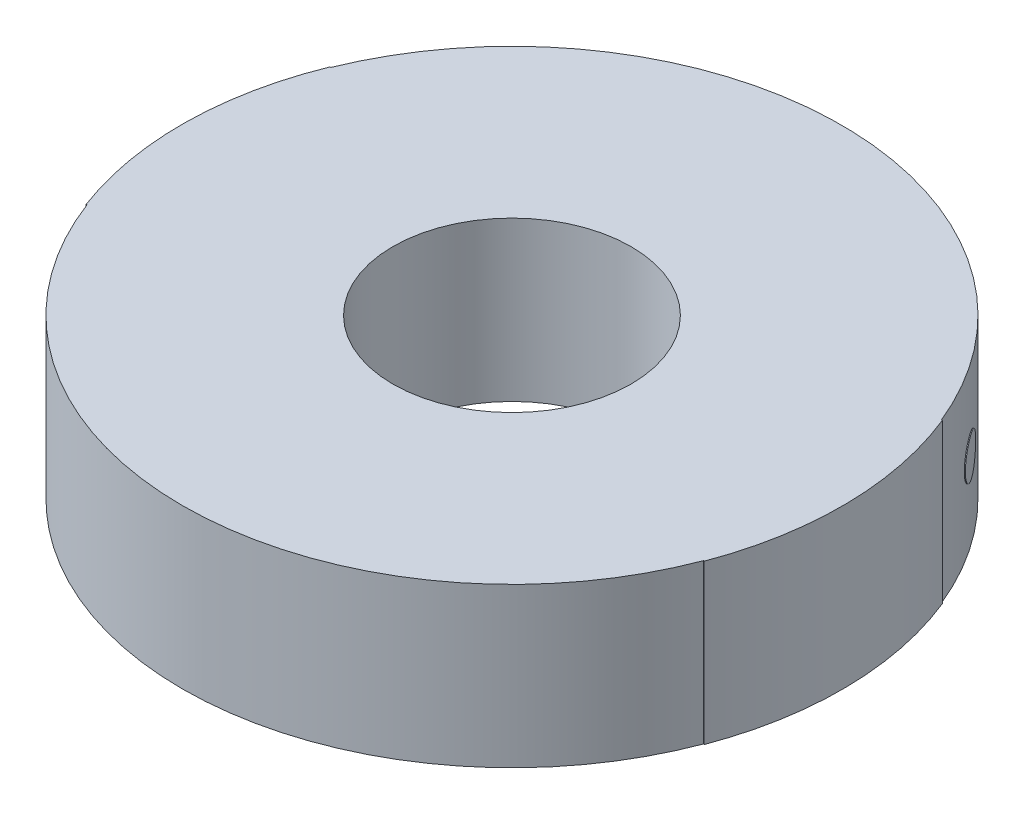
ISO-10303-21;
HEADER;
FILE_DESCRIPTION(('STEP AP214'),'2;1');
FILE_NAME('part.step','',(''),(''),'','','');
FILE_SCHEMA(('AUTOMOTIVE_DESIGN { 1 0 10303 214 1 1 1 1 }'));
ENDSEC;
DATA;
#1=APPLICATION_CONTEXT('core data for automotive mechanical design processes');
#2=APPLICATION_PROTOCOL_DEFINITION('international standard','automotive_design',2000,#1);
#3=PRODUCT_CONTEXT('',#1,'mechanical');
#4=PRODUCT('Part','Part','',(#3));
#5=PRODUCT_RELATED_PRODUCT_CATEGORY('part','',(#4));
#6=PRODUCT_DEFINITION_FORMATION('','',#4);
#7=PRODUCT_DEFINITION_CONTEXT('part definition',#1,'design');
#8=PRODUCT_DEFINITION('design','',#6,#7);
#9=PRODUCT_DEFINITION_SHAPE('','',#8);
#10=(LENGTH_UNIT() NAMED_UNIT(*) SI_UNIT(.MILLI.,.METRE.));
#11=(NAMED_UNIT(*) PLANE_ANGLE_UNIT() SI_UNIT($,.RADIAN.));
#12=(NAMED_UNIT(*) SI_UNIT($,.STERADIAN.) SOLID_ANGLE_UNIT());
#13=UNCERTAINTY_MEASURE_WITH_UNIT(LENGTH_MEASURE(1.E-05),#10,'distance_accuracy_value','');
#14=(GEOMETRIC_REPRESENTATION_CONTEXT(3) GLOBAL_UNCERTAINTY_ASSIGNED_CONTEXT((#13)) GLOBAL_UNIT_ASSIGNED_CONTEXT((#10,
#11,#12)) REPRESENTATION_CONTEXT('',''));
#15=CARTESIAN_POINT('',(0.,0.,0.));
#16=DIRECTION('',(0.,0.,1.));
#17=DIRECTION('',(1.,0.,0.));
#18=AXIS2_PLACEMENT_3D('',#15,#16,#17);
#19=CARTESIAN_POINT('',(0.,2.,0.));
#20=DIRECTION('',(0.,-1.,0.));
#21=DIRECTION('',(0.,0.,-1.));
#22=AXIS2_PLACEMENT_3D('',#19,#20,#21);
#23=CYLINDRICAL_SURFACE('',#22,4.15);
#24=CARTESIAN_POINT('',(3.27171196649209,1.,-2.55311590185648));
#25=CARTESIAN_POINT('',(3.27179390586077,1.06659109797606,-2.55301089995946));
#26=CARTESIAN_POINT('',(3.28809508042966,1.12993035868716,-2.53241457169002));
#27=CARTESIAN_POINT('',(3.34440087998526,1.2236230166176,-2.45757514123322));
#28=CARTESIAN_POINT('',(3.38195425068374,1.24998679026527,-2.40609078556478));
#29=CARTESIAN_POINT('',(3.45701863991068,1.25001320768777,-2.29693481522825));
#30=CARTESIAN_POINT('',(3.49164458622082,1.22360415277622,-2.24345997363565));
#31=CARTESIAN_POINT('',(3.54139787580177,1.12994919176796,-2.16406923527349));
#32=CARTESIAN_POINT('',(3.55478739656431,1.06595096524728,-2.14149167231975));
#33=CARTESIAN_POINT('',(3.55492347564171,0.934048988847038,-2.14126577045419));
#34=CARTESIAN_POINT('',(3.5413880008748,0.870069646181466,-2.16408499327242));
#35=CARTESIAN_POINT('',(3.49165442644874,0.776376944812536,-2.24344427100559));
#36=CARTESIAN_POINT('',(3.45701845968599,0.750013269719223,-2.29693507859742));
#37=CARTESIAN_POINT('',(3.38195437889558,0.749986731627781,-2.40609059783085));
#38=CARTESIAN_POINT('',(3.34441217971716,0.776395645154479,-2.45756012268589));
#39=CARTESIAN_POINT('',(3.28808374181886,0.870051044706398,-2.53242964191365));
#40=CARTESIAN_POINT('',(3.27163002712342,0.93340890202394,-2.55322090375351));
#41=CARTESIAN_POINT('',(3.27171196649209,1.,-2.55311590185648));
#42=B_SPLINE_CURVE_WITH_KNOTS('',3,(#24,#25,#26,#27,#28,#29,#30,#31,#32,#33,#34,#35,#36,#37,#38,
#39,#40,#41),.UNSPECIFIED.,.T.,.F.,(4,2,2,2,2,2,2,2,4),(0.,0.125,0.25,0.375,0.5,0.625,0.75,
0.875,1.),.UNSPECIFIED.);
#43=CARTESIAN_POINT('',(3.27171196649209,1.,-2.55311590185648));
#44=VERTEX_POINT('',#43);
#45=EDGE_CURVE('E13',#44,#44,#42,.T.);
#46=ORIENTED_EDGE('',*,*,#45,.F.);
#47=EDGE_LOOP('',(#46));
#48=FACE_BOUND('',#47,.T.);
#49=CARTESIAN_POINT('',(0.,0.,0.));
#50=DIRECTION('',(0.,1.,0.));
#51=DIRECTION('',(0.,0.,1.));
#52=AXIS2_PLACEMENT_3D('',#49,#50,#51);
#53=CIRCLE('',#52,4.15);
#54=CARTESIAN_POINT('',(3.84536792228623,0.,-1.56065548480504));
#55=VERTEX_POINT('',#54);
#56=CARTESIAN_POINT('',(-3.84536792228623,0.,-1.56065548480504));
#57=VERTEX_POINT('',#56);
#58=EDGE_CURVE('E152',#55,#57,#53,.T.);
#59=ORIENTED_EDGE('',*,*,#58,.T.);
#60=DIRECTION('',(0.,1.,0.));
#61=VECTOR('',#60,1.);
#62=CARTESIAN_POINT('',(-3.84536792228623,0.,-1.56065548480504));
#63=LINE('',#62,#61);
#64=CARTESIAN_POINT('',(-3.84536792228623,2.,-1.56065548480504));
#65=VERTEX_POINT('',#64);
#66=EDGE_CURVE('E101',#57,#65,#63,.T.);
#67=ORIENTED_EDGE('',*,*,#66,.T.);
#68=CARTESIAN_POINT('',(0.,2.,0.));
#69=DIRECTION('',(0.,1.,0.));
#70=DIRECTION('',(0.,0.,1.));
#71=AXIS2_PLACEMENT_3D('',#68,#69,#70);
#72=CIRCLE('',#71,4.15);
#73=CARTESIAN_POINT('',(3.84536792228623,2.,-1.56065548480504));
#74=VERTEX_POINT('',#73);
#75=EDGE_CURVE('E86',#74,#65,#72,.T.);
#76=ORIENTED_EDGE('',*,*,#75,.F.);
#77=DIRECTION('',(0.,1.,0.));
#78=VECTOR('',#77,1.);
#79=CARTESIAN_POINT('',(3.84536792228623,0.,-1.56065548480504));
#80=LINE('',#79,#78);
#81=EDGE_CURVE('E242',#55,#74,#80,.T.);
#82=ORIENTED_EDGE('',*,*,#81,.F.);
#83=EDGE_LOOP('',(#59,#67,#76,#82));
#84=FACE_BOUND('',#83,.T.);
#85=ADVANCED_FACE('F75',(#48,#84),#23,.T.);
#86=CARTESIAN_POINT('',(-3.88185411428932,2.,1.46755191914123));
#87=VERTEX_POINT('',#86);
#88=CARTESIAN_POINT('',(3.88185411428932,2.,1.46755191914123));
#89=VERTEX_POINT('',#88);
#90=EDGE_CURVE('E93',#87,#89,#72,.T.);
#91=ORIENTED_EDGE('',*,*,#90,.F.);
#92=DIRECTION('',(0.,-1.,0.));
#93=VECTOR('',#92,1.);
#94=CARTESIAN_POINT('',(-3.88185411428932,2.,1.46755191914123));
#95=LINE('',#94,#93);
#96=CARTESIAN_POINT('',(-3.88185411428932,0.,1.46755191914123));
#97=VERTEX_POINT('',#96);
#98=EDGE_CURVE('E156',#87,#97,#95,.T.);
#99=ORIENTED_EDGE('',*,*,#98,.T.);
#100=CARTESIAN_POINT('',(3.88185411428932,0.,1.46755191914123));
#101=VERTEX_POINT('',#100);
#102=EDGE_CURVE('E143',#97,#101,#53,.T.);
#103=ORIENTED_EDGE('',*,*,#102,.T.);
#104=DIRECTION('',(0.,-1.,0.));
#105=VECTOR('',#104,1.);
#106=CARTESIAN_POINT('',(3.88185411428932,2.,1.46755191914123));
#107=LINE('',#106,#105);
#108=EDGE_CURVE('E227',#89,#101,#107,.T.);
#109=ORIENTED_EDGE('',*,*,#108,.F.);
#110=EDGE_LOOP('',(#91,#99,#103,#109));
#111=FACE_BOUND('',#110,.T.);
#112=ADVANCED_FACE('F77',(#111),#23,.T.);
#113=CARTESIAN_POINT('',(0.,2.,0.));
#114=DIRECTION('',(0.,1.,0.));
#115=DIRECTION('',(0.,0.,1.));
#116=AXIS2_PLACEMENT_3D('',#113,#114,#115);
#117=PLANE('',#116);
#118=CARTESIAN_POINT('',(0.,2.,0.));
#119=DIRECTION('',(0.,1.,0.));
#120=DIRECTION('',(0.,0.,1.));
#121=AXIS2_PLACEMENT_3D('',#118,#119,#120);
#122=CIRCLE('',#121,1.5);
#123=CARTESIAN_POINT('',(0.,2.,1.5));
#124=VERTEX_POINT('',#123);
#125=EDGE_CURVE('E284',#124,#124,#122,.T.);
#126=ORIENTED_EDGE('',*,*,#125,.F.);
#127=EDGE_LOOP('',(#126));
#128=FACE_BOUND('',#127,.T.);
#129=ORIENTED_EDGE('',*,*,#75,.T.);
#130=DIRECTION('',(0.926594680068972,0.,0.376061562603624));
#131=VECTOR('',#130,1.);
#132=CARTESIAN_POINT('',(-3.84536792228623,2.,-1.56065548480504));
#133=LINE('',#132,#131);
#134=CARTESIAN_POINT('',(-3.85463386908692,2.,-1.56441610043107));
#135=VERTEX_POINT('',#134);
#136=EDGE_CURVE('E167',#135,#65,#133,.T.);
#137=ORIENTED_EDGE('',*,*,#136,.F.);
#138=CARTESIAN_POINT('',(0.,2.,0.));
#139=DIRECTION('',(0.,-1.,0.));
#140=DIRECTION('',(0.,0.,-1.));
#141=AXIS2_PLACEMENT_3D('',#138,#139,#140);
#142=CIRCLE('',#141,4.16);
#143=CARTESIAN_POINT('',(-3.89120797962495,2.,1.47108818882591));
#144=VERTEX_POINT('',#143);
#145=EDGE_CURVE('E159',#135,#144,#142,.F.);
#146=ORIENTED_EDGE('',*,*,#145,.T.);
#147=DIRECTION('',(0.93538653356369,0.,-0.353626968467767));
#148=VECTOR('',#147,1.);
#149=CARTESIAN_POINT('',(-3.88185411428932,2.,1.46755191914123));
#150=LINE('',#149,#148);
#151=EDGE_CURVE('E165',#144,#87,#150,.T.);
#152=ORIENTED_EDGE('',*,*,#151,.T.);
#153=ORIENTED_EDGE('',*,*,#90,.T.);
#154=DIRECTION('',(0.935386533563691,0.,0.353626968467767));
#155=VECTOR('',#154,1.);
#156=CARTESIAN_POINT('',(3.88185411428932,2.,1.46755191914123));
#157=LINE('',#156,#155);
#158=CARTESIAN_POINT('',(3.89120797962495,2.,1.47108818882591));
#159=VERTEX_POINT('',#158);
#160=EDGE_CURVE('E153',#89,#159,#157,.T.);
#161=ORIENTED_EDGE('',*,*,#160,.T.);
#162=CARTESIAN_POINT('',(0.,2.,0.));
#163=DIRECTION('',(0.,-1.,0.));
#164=DIRECTION('',(0.,0.,-1.));
#165=AXIS2_PLACEMENT_3D('',#162,#163,#164);
#166=CIRCLE('',#165,4.16);
#167=CARTESIAN_POINT('',(3.85463386908692,2.,-1.56441610043108));
#168=VERTEX_POINT('',#167);
#169=EDGE_CURVE('E226',#159,#168,#166,.F.);
#170=ORIENTED_EDGE('',*,*,#169,.T.);
#171=DIRECTION('',(0.926594680068972,0.,-0.376061562603624));
#172=VECTOR('',#171,1.);
#173=CARTESIAN_POINT('',(3.84536792228623,2.,-1.56065548480504));
#174=LINE('',#173,#172);
#175=EDGE_CURVE('E232',#74,#168,#174,.T.);
#176=ORIENTED_EDGE('',*,*,#175,.F.);
#177=EDGE_LOOP('',(#129,#137,#146,#152,#153,#161,#170,#176));
#178=FACE_BOUND('',#177,.T.);
#179=ADVANCED_FACE('F345',(#128,#178),#117,.T.);
#180=CARTESIAN_POINT('',(0.,0.,0.));
#181=DIRECTION('',(0.,1.,0.));
#182=DIRECTION('',(0.,0.,1.));
#183=AXIS2_PLACEMENT_3D('',#180,#181,#182);
#184=PLANE('',#183);
#185=CARTESIAN_POINT('',(0.,0.,0.));
#186=DIRECTION('',(0.,1.,0.));
#187=DIRECTION('',(0.,0.,1.));
#188=AXIS2_PLACEMENT_3D('',#185,#186,#187);
#189=CIRCLE('',#188,1.5);
#190=CARTESIAN_POINT('',(0.,0.,1.5));
#191=VERTEX_POINT('',#190);
#192=EDGE_CURVE('E80',#191,#191,#189,.T.);
#193=ORIENTED_EDGE('',*,*,#192,.T.);
#194=EDGE_LOOP('',(#193));
#195=FACE_BOUND('',#194,.T.);
#196=ORIENTED_EDGE('',*,*,#58,.F.);
#197=DIRECTION('',(0.926594680068972,0.,-0.376061562603624));
#198=VECTOR('',#197,1.);
#199=CARTESIAN_POINT('',(3.84536792228623,0.,-1.56065548480504));
#200=LINE('',#199,#198);
#201=CARTESIAN_POINT('',(3.85463386908692,0.,-1.56441610043108));
#202=VERTEX_POINT('',#201);
#203=EDGE_CURVE('E247',#55,#202,#200,.T.);
#204=ORIENTED_EDGE('',*,*,#203,.T.);
#205=CARTESIAN_POINT('',(0.,0.,0.));
#206=DIRECTION('',(0.,-1.,0.));
#207=DIRECTION('',(0.,0.,-1.));
#208=AXIS2_PLACEMENT_3D('',#205,#206,#207);
#209=CIRCLE('',#208,4.16);
#210=CARTESIAN_POINT('',(3.89120797962495,0.,1.47108818882591));
#211=VERTEX_POINT('',#210);
#212=EDGE_CURVE('E228',#211,#202,#209,.F.);
#213=ORIENTED_EDGE('',*,*,#212,.F.);
#214=DIRECTION('',(0.935386533563691,0.,0.353626968467767));
#215=VECTOR('',#214,1.);
#216=CARTESIAN_POINT('',(3.88185411428932,0.,1.46755191914123));
#217=LINE('',#216,#215);
#218=EDGE_CURVE('E150',#101,#211,#217,.T.);
#219=ORIENTED_EDGE('',*,*,#218,.F.);
#220=ORIENTED_EDGE('',*,*,#102,.F.);
#221=DIRECTION('',(0.93538653356369,0.,-0.353626968467767));
#222=VECTOR('',#221,1.);
#223=CARTESIAN_POINT('',(-3.88185411428932,0.,1.46755191914123));
#224=LINE('',#223,#222);
#225=CARTESIAN_POINT('',(-3.89120797962495,0.,1.47108818882591));
#226=VERTEX_POINT('',#225);
#227=EDGE_CURVE('E147',#226,#97,#224,.T.);
#228=ORIENTED_EDGE('',*,*,#227,.F.);
#229=CARTESIAN_POINT('',(0.,0.,0.));
#230=DIRECTION('',(0.,-1.,0.));
#231=DIRECTION('',(0.,0.,-1.));
#232=AXIS2_PLACEMENT_3D('',#229,#230,#231);
#233=CIRCLE('',#232,4.16);
#234=CARTESIAN_POINT('',(-3.85463386908692,0.,-1.56441610043107));
#235=VERTEX_POINT('',#234);
#236=EDGE_CURVE('E267',#235,#226,#233,.F.);
#237=ORIENTED_EDGE('',*,*,#236,.F.);
#238=DIRECTION('',(0.926594680068972,0.,0.376061562603623));
#239=VECTOR('',#238,1.);
#240=CARTESIAN_POINT('',(-3.84536792228623,0.,-1.56065548480504));
#241=LINE('',#240,#239);
#242=EDGE_CURVE('E173',#235,#57,#241,.T.);
#243=ORIENTED_EDGE('',*,*,#242,.T.);
#244=EDGE_LOOP('',(#196,#204,#213,#219,#220,#228,#237,#243));
#245=FACE_BOUND('',#244,.T.);
#246=ADVANCED_FACE('F144',(#195,#245),#184,.F.);
#247=CARTESIAN_POINT('',(3.88185411428932,1.,1.46755191914123));
#248=DIRECTION('',(-0.353626968467767,0.,0.935386533563691));
#249=DIRECTION('',(0.,-1.,0.));
#250=AXIS2_PLACEMENT_3D('',#247,#248,#249);
#251=PLANE('',#250);
#252=ORIENTED_EDGE('',*,*,#160,.F.);
#253=ORIENTED_EDGE('',*,*,#108,.T.);
#254=ORIENTED_EDGE('',*,*,#218,.T.);
#255=DIRECTION('',(0.,-1.,0.));
#256=VECTOR('',#255,1.);
#257=CARTESIAN_POINT('',(3.89120797962495,2.,1.47108818882591));
#258=LINE('',#257,#256);
#259=EDGE_CURVE('E233',#159,#211,#258,.T.);
#260=ORIENTED_EDGE('',*,*,#259,.F.);
#261=EDGE_LOOP('',(#252,#253,#254,#260));
#262=FACE_BOUND('',#261,.T.);
#263=ADVANCED_FACE('F331',(#262),#251,.T.);
#264=CARTESIAN_POINT('',(3.84536792228623,1.,-1.56065548480504));
#265=DIRECTION('',(-0.376061562603624,0.,-0.926594680068972));
#266=DIRECTION('',(0.,1.,0.));
#267=AXIS2_PLACEMENT_3D('',#264,#265,#266);
#268=PLANE('',#267);
#269=ORIENTED_EDGE('',*,*,#203,.F.);
#270=ORIENTED_EDGE('',*,*,#81,.T.);
#271=ORIENTED_EDGE('',*,*,#175,.T.);
#272=DIRECTION('',(0.,-1.,0.));
#273=VECTOR('',#272,1.);
#274=CARTESIAN_POINT('',(3.85463386908692,2.,-1.56441610043108));
#275=LINE('',#274,#273);
#276=EDGE_CURVE('E217',#202,#168,#275,.F.);
#277=ORIENTED_EDGE('',*,*,#276,.F.);
#278=EDGE_LOOP('',(#269,#270,#271,#277));
#279=FACE_BOUND('',#278,.T.);
#280=ADVANCED_FACE('F324',(#279),#268,.T.);
#281=CARTESIAN_POINT('',(0.,2.,0.));
#282=DIRECTION('',(0.,-1.,0.));
#283=DIRECTION('',(0.,0.,-1.));
#284=AXIS2_PLACEMENT_3D('',#281,#282,#283);
#285=CYLINDRICAL_SURFACE('',#284,4.16);
#286=ORIENTED_EDGE('',*,*,#276,.T.);
#287=ORIENTED_EDGE('',*,*,#169,.F.);
#288=ORIENTED_EDGE('',*,*,#259,.T.);
#289=ORIENTED_EDGE('',*,*,#212,.T.);
#290=EDGE_LOOP('',(#286,#287,#288,#289));
#291=FACE_BOUND('',#290,.T.);
#292=ADVANCED_FACE('F200',(#291),#285,.T.);
#293=CARTESIAN_POINT('',(3.27959560978485,1.,-2.55926798836698));
#294=CARTESIAN_POINT('',(3.27967774659778,1.06659109797606,-2.55916273345334));
#295=CARTESIAN_POINT('',(3.29601820110539,1.12993035868716,-2.53851677547723));
#296=CARTESIAN_POINT('',(3.35245967728643,1.2236230166176,-2.46349700904342));
#297=CARTESIAN_POINT('',(3.39010353803478,1.24998679026527,-2.41188859468662));
#298=CARTESIAN_POINT('',(3.46534880530806,1.25001320768777,-2.30246959791555));
#299=CARTESIAN_POINT('',(3.5000581876334,1.22360415277622,-2.24886590128297));
#300=CARTESIAN_POINT('',(3.54993136465912,1.12994919176796,-2.1692838599368));
#301=CARTESIAN_POINT('',(3.56335314932711,1.06595096524728,-2.14665189321691));
#302=CARTESIAN_POINT('',(3.5634895563059,0.934048988847038,-2.14642544700951));
#303=CARTESIAN_POINT('',(3.54992146593715,0.870069646181466,-2.16929965590681));
#304=CARTESIAN_POINT('',(3.50006805157272,0.776376944812536,-2.24885016081524));
#305=CARTESIAN_POINT('',(3.46534862464909,0.750013269719223,-2.30246986191934));
#306=CARTESIAN_POINT('',(3.39010366655557,0.749986731627781,-2.41188840650032));
#307=CARTESIAN_POINT('',(3.3524710042466,0.776395645154479,-2.46348195430682));
#308=CARTESIAN_POINT('',(3.29600683517264,0.870051044706398,-2.53853188201464));
#309=CARTESIAN_POINT('',(3.27951347297191,0.93340890202394,-2.55937324328062));
#310=CARTESIAN_POINT('',(3.27959560978485,1.,-2.55926798836698));
#311=CARTESIAN_POINT('',(3.27171196649209,1.,-2.55311590185648));
#312=CARTESIAN_POINT('',(3.27179390586077,1.06659109797606,-2.55301089995946));
#313=CARTESIAN_POINT('',(3.28809508042966,1.12993035868716,-2.53241457169002));
#314=CARTESIAN_POINT('',(3.34440087998526,1.2236230166176,-2.45757514123322));
#315=CARTESIAN_POINT('',(3.38195425068374,1.24998679026527,-2.40609078556478));
#316=CARTESIAN_POINT('',(3.45701863991068,1.25001320768777,-2.29693481522825));
#317=CARTESIAN_POINT('',(3.49164458622082,1.22360415277622,-2.24345997363565));
#318=CARTESIAN_POINT('',(3.54139787580177,1.12994919176796,-2.16406923527349));
#319=CARTESIAN_POINT('',(3.55478739656431,1.06595096524728,-2.14149167231975));
#320=CARTESIAN_POINT('',(3.55492347564171,0.934048988847038,-2.14126577045419));
#321=CARTESIAN_POINT('',(3.5413880008748,0.870069646181466,-2.16408499327242));
#322=CARTESIAN_POINT('',(3.49165442644874,0.776376944812536,-2.24344427100559));
#323=CARTESIAN_POINT('',(3.45701845968599,0.750013269719223,-2.29693507859742));
#324=CARTESIAN_POINT('',(3.38195437889558,0.749986731627781,-2.40609059783085));
#325=CARTESIAN_POINT('',(3.34441217971716,0.776395645154479,-2.45756012268589));
#326=CARTESIAN_POINT('',(3.28808374181886,0.870051044706398,-2.53242964191365));
#327=CARTESIAN_POINT('',(3.27163002712342,0.93340890202394,-2.55322090375351));
#328=CARTESIAN_POINT('',(3.27171196649209,1.,-2.55311590185648));
#329=B_SPLINE_SURFACE_WITH_KNOTS('',1,3,((#293,#294,#295,#296,#297,#298,#299,#300,#301,#302,
#303,#304,#305,#306,#307,#308,#309,#310),(#311,#312,#313,#314,#315,#316,#317,#318,#319,#320,
#321,#322,#323,#324,#325,#326,#327,#328)),.UNSPECIFIED.,.F.,.T.,.F.,(2,2),(4,2,2,2,2,2,2,2,4),
(0.,1.),(0.,0.125,0.25,0.375,0.5,0.625,0.75,0.875,1.),.UNSPECIFIED.);
#330=CARTESIAN_POINT('',(3.27959560978485,1.,-2.55926798836698));
#331=CARTESIAN_POINT('',(3.27951347297191,0.93340890202394,-2.55937324328062));
#332=CARTESIAN_POINT('',(3.29600683517264,0.870051044706398,-2.53853188201464));
#333=CARTESIAN_POINT('',(3.3524710042466,0.776395645154479,-2.46348195430682));
#334=CARTESIAN_POINT('',(3.39010366655557,0.749986731627781,-2.41188840650032));
#335=CARTESIAN_POINT('',(3.46534862464909,0.750013269719223,-2.30246986191934));
#336=CARTESIAN_POINT('',(3.50006805157272,0.776376944812536,-2.24885016081524));
#337=CARTESIAN_POINT('',(3.54992146593715,0.870069646181466,-2.16929965590681));
#338=CARTESIAN_POINT('',(3.5634895563059,0.934048988847038,-2.14642544700951));
#339=CARTESIAN_POINT('',(3.56335314932711,1.06595096524728,-2.14665189321691));
#340=CARTESIAN_POINT('',(3.54993136465912,1.12994919176796,-2.1692838599368));
#341=CARTESIAN_POINT('',(3.5000581876334,1.22360415277622,-2.24886590128297));
#342=CARTESIAN_POINT('',(3.46534880530806,1.25001320768777,-2.30246959791555));
#343=CARTESIAN_POINT('',(3.39010353803478,1.24998679026527,-2.41188859468662));
#344=CARTESIAN_POINT('',(3.35245967728643,1.2236230166176,-2.46349700904342));
#345=CARTESIAN_POINT('',(3.29601820110539,1.12993035868716,-2.53851677547723));
#346=CARTESIAN_POINT('',(3.27967774659778,1.06659109797606,-2.55916273345334));
#347=CARTESIAN_POINT('',(3.27959560978485,1.,-2.55926798836698));
#348=B_SPLINE_CURVE_WITH_KNOTS('',3,(#330,#331,#332,#333,#334,#335,#336,#337,#338,#339,#340,
#341,#342,#343,#344,#345,#346,#347),.UNSPECIFIED.,.T.,.F.,(4,2,2,2,2,2,2,2,4),(0.,0.125,0.25,
0.375,0.5,0.625,0.75,0.875,1.),.UNSPECIFIED.);
#349=CARTESIAN_POINT('',(3.27959560978485,1.,-2.55926798836698));
#350=VERTEX_POINT('',#349);
#351=EDGE_CURVE('E246',#350,#350,#348,.F.);
#352=ORIENTED_EDGE('',*,*,#351,.F.);
#353=EDGE_LOOP('',(#352));
#354=FACE_BOUND('',#353,.T.);
#355=ORIENTED_EDGE('',*,*,#45,.T.);
#356=EDGE_LOOP('',(#355));
#357=FACE_BOUND('',#356,.T.);
#358=ADVANCED_FACE('F192',(#354,#357),#329,.T.);
#359=CARTESIAN_POINT('',(0.,2.,0.));
#360=DIRECTION('',(0.,-1.,0.));
#361=DIRECTION('',(0.,0.,-1.));
#362=AXIS2_PLACEMENT_3D('',#359,#360,#361);
#363=CYLINDRICAL_SURFACE('',#362,4.16);
#364=ORIENTED_EDGE('',*,*,#351,.T.);
#365=EDGE_LOOP('',(#364));
#366=FACE_BOUND('',#365,.T.);
#367=ADVANCED_FACE('F181',(#366),#363,.T.);
#368=CARTESIAN_POINT('',(-3.84536792228623,1.,-1.56065548480504));
#369=DIRECTION('',(-0.376061562603623,0.,0.926594680068972));
#370=DIRECTION('',(0.,1.,0.));
#371=AXIS2_PLACEMENT_3D('',#368,#369,#370);
#372=PLANE('',#371);
#373=ORIENTED_EDGE('',*,*,#242,.F.);
#374=DIRECTION('',(0.,-1.,0.));
#375=VECTOR('',#374,1.);
#376=CARTESIAN_POINT('',(-3.85463386908692,2.,-1.56441610043107));
#377=LINE('',#376,#375);
#378=EDGE_CURVE('E272',#235,#135,#377,.F.);
#379=ORIENTED_EDGE('',*,*,#378,.T.);
#380=ORIENTED_EDGE('',*,*,#136,.T.);
#381=ORIENTED_EDGE('',*,*,#66,.F.);
#382=EDGE_LOOP('',(#373,#379,#380,#381));
#383=FACE_BOUND('',#382,.T.);
#384=ADVANCED_FACE('F191',(#383),#372,.F.);
#385=CARTESIAN_POINT('',(-3.88185411428932,1.,1.46755191914123));
#386=DIRECTION('',(-0.353626968467766,0.,-0.935386533563691));
#387=DIRECTION('',(0.,-1.,0.));
#388=AXIS2_PLACEMENT_3D('',#385,#386,#387);
#389=PLANE('',#388);
#390=ORIENTED_EDGE('',*,*,#151,.F.);
#391=DIRECTION('',(0.,-1.,0.));
#392=VECTOR('',#391,1.);
#393=CARTESIAN_POINT('',(-3.89120797962495,2.,1.47108818882591));
#394=LINE('',#393,#392);
#395=EDGE_CURVE('E164',#144,#226,#394,.T.);
#396=ORIENTED_EDGE('',*,*,#395,.T.);
#397=ORIENTED_EDGE('',*,*,#227,.T.);
#398=ORIENTED_EDGE('',*,*,#98,.F.);
#399=EDGE_LOOP('',(#390,#396,#397,#398));
#400=FACE_BOUND('',#399,.T.);
#401=ADVANCED_FACE('F162',(#400),#389,.F.);
#402=CARTESIAN_POINT('',(0.,2.,0.));
#403=DIRECTION('',(0.,-1.,0.));
#404=DIRECTION('',(0.,0.,-1.));
#405=AXIS2_PLACEMENT_3D('',#402,#403,#404);
#406=CYLINDRICAL_SURFACE('',#405,4.16);
#407=ORIENTED_EDGE('',*,*,#395,.F.);
#408=ORIENTED_EDGE('',*,*,#145,.F.);
#409=ORIENTED_EDGE('',*,*,#378,.F.);
#410=ORIENTED_EDGE('',*,*,#236,.T.);
#411=EDGE_LOOP('',(#407,#408,#409,#410));
#412=FACE_BOUND('',#411,.T.);
#413=ADVANCED_FACE('F295',(#412),#406,.T.);
#414=CARTESIAN_POINT('',(0.,-7.999,0.));
#415=DIRECTION('',(0.,1.,0.));
#416=DIRECTION('',(0.,0.,1.));
#417=AXIS2_PLACEMENT_3D('',#414,#415,#416);
#418=CYLINDRICAL_SURFACE('',#417,1.5);
#419=ORIENTED_EDGE('',*,*,#125,.T.);
#420=EDGE_LOOP('',(#419));
#421=FACE_BOUND('',#420,.T.);
#422=ORIENTED_EDGE('',*,*,#192,.F.);
#423=EDGE_LOOP('',(#422));
#424=FACE_BOUND('',#423,.T.);
#425=ADVANCED_FACE('F293',(#421,#424),#418,.F.);
#426=CLOSED_SHELL('',(#85,#112,#179,#246,#263,#280,#292,#358,#367,#384,#401,#413,#425));
#427=MANIFOLD_SOLID_BREP('B2',#426);
#428=ADVANCED_BREP_SHAPE_REPRESENTATION('',(#18,#427),#14);
#429=SHAPE_DEFINITION_REPRESENTATION(#9,#428);
ENDSEC;
END-ISO-10303-21;
